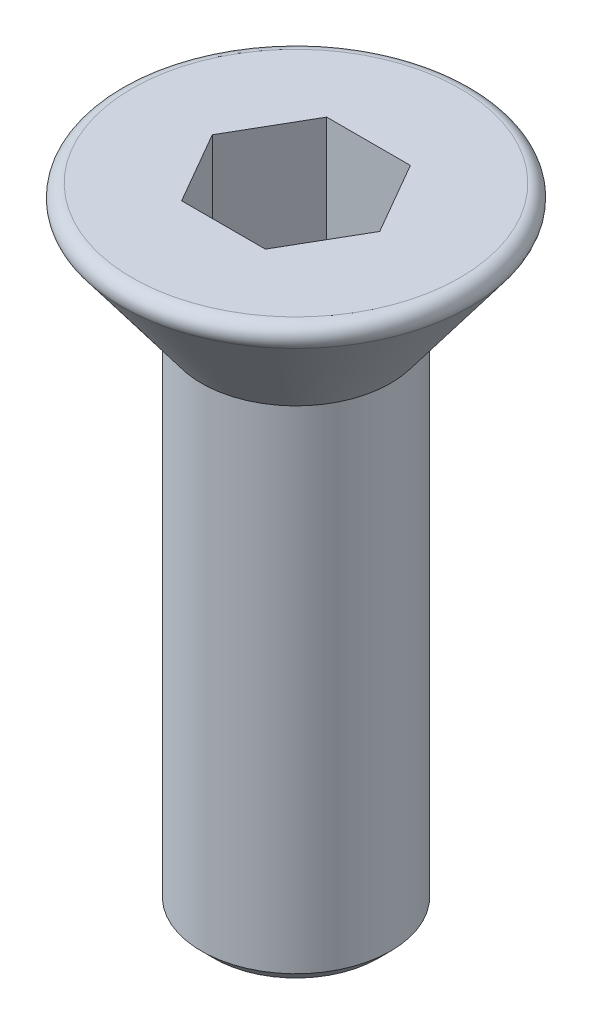
ISO-10303-21;
HEADER;
FILE_DESCRIPTION(('STEP AP214'),'2;1');
FILE_NAME('part.step','',(''),(''),'','','');
FILE_SCHEMA(('AUTOMOTIVE_DESIGN { 1 0 10303 214 1 1 1 1 }'));
ENDSEC;
DATA;
#1=APPLICATION_CONTEXT('core data for automotive mechanical design processes');
#2=APPLICATION_PROTOCOL_DEFINITION('international standard','automotive_design',2000,#1);
#3=PRODUCT_CONTEXT('',#1,'mechanical');
#4=PRODUCT('Part','Part','',(#3));
#5=PRODUCT_RELATED_PRODUCT_CATEGORY('part','',(#4));
#6=PRODUCT_DEFINITION_FORMATION('','',#4);
#7=PRODUCT_DEFINITION_CONTEXT('part definition',#1,'design');
#8=PRODUCT_DEFINITION('design','',#6,#7);
#9=PRODUCT_DEFINITION_SHAPE('','',#8);
#10=(LENGTH_UNIT() NAMED_UNIT(*) SI_UNIT(.MILLI.,.METRE.));
#11=(NAMED_UNIT(*) PLANE_ANGLE_UNIT() SI_UNIT($,.RADIAN.));
#12=(NAMED_UNIT(*) SI_UNIT($,.STERADIAN.) SOLID_ANGLE_UNIT());
#13=UNCERTAINTY_MEASURE_WITH_UNIT(LENGTH_MEASURE(1.E-05),#10,'distance_accuracy_value','');
#14=(GEOMETRIC_REPRESENTATION_CONTEXT(3) GLOBAL_UNCERTAINTY_ASSIGNED_CONTEXT((#13)) GLOBAL_UNIT_ASSIGNED_CONTEXT((#10,
#11,#12)) REPRESENTATION_CONTEXT('',''));
#15=CARTESIAN_POINT('',(0.,0.,0.));
#16=DIRECTION('',(0.,0.,1.));
#17=DIRECTION('',(1.,0.,0.));
#18=AXIS2_PLACEMENT_3D('',#15,#16,#17);
#19=CARTESIAN_POINT('',(3.,0.,0.));
#20=DIRECTION('',(0.,-1.,0.));
#21=DIRECTION('',(1.,0.,0.));
#22=AXIS2_PLACEMENT_3D('',#19,#20,#21);
#23=PLANE('',#22);
#24=CARTESIAN_POINT('',(0.,0.,0.));
#25=DIRECTION('',(0.,-1.,0.));
#26=DIRECTION('',(1.,0.,0.));
#27=AXIS2_PLACEMENT_3D('',#24,#25,#26);
#28=CIRCLE('',#27,2.6);
#29=CARTESIAN_POINT('',(2.6,0.,0.));
#30=VERTEX_POINT('',#29);
#31=EDGE_CURVE('E44',#30,#30,#28,.F.);
#32=ORIENTED_EDGE('',*,*,#31,.T.);
#33=EDGE_LOOP('',(#32));
#34=FACE_BOUND('',#33,.T.);
#35=DIRECTION('',(0.5,0.,0.866025403784439));
#36=VECTOR('',#35,1.);
#37=CARTESIAN_POINT('',(-1.32790561913614,0.,0.));
#38=LINE('',#37,#36);
#39=CARTESIAN_POINT('',(-1.32790561913614,0.,0.));
#40=VERTEX_POINT('',#39);
#41=CARTESIAN_POINT('',(-0.66395280956807,0.,1.15));
#42=VERTEX_POINT('',#41);
#43=EDGE_CURVE('E125',#40,#42,#38,.T.);
#44=ORIENTED_EDGE('',*,*,#43,.F.);
#45=DIRECTION('',(-0.5,0.,0.866025403784438));
#46=VECTOR('',#45,1.);
#47=CARTESIAN_POINT('',(-0.66395280956807,0.,-1.15));
#48=LINE('',#47,#46);
#49=CARTESIAN_POINT('',(-0.66395280956807,0.,-1.15));
#50=VERTEX_POINT('',#49);
#51=EDGE_CURVE('E51',#50,#40,#48,.T.);
#52=ORIENTED_EDGE('',*,*,#51,.F.);
#53=DIRECTION('',(-1.,0.,0.));
#54=VECTOR('',#53,1.);
#55=CARTESIAN_POINT('',(0.66395280956807,0.,-1.15));
#56=LINE('',#55,#54);
#57=CARTESIAN_POINT('',(0.66395280956807,0.,-1.15));
#58=VERTEX_POINT('',#57);
#59=EDGE_CURVE('E134',#58,#50,#56,.T.);
#60=ORIENTED_EDGE('',*,*,#59,.F.);
#61=DIRECTION('',(-0.5,0.,-0.866025403784439));
#62=VECTOR('',#61,1.);
#63=CARTESIAN_POINT('',(1.32790561913614,0.,0.));
#64=LINE('',#63,#62);
#65=CARTESIAN_POINT('',(1.32790561913614,0.,0.));
#66=VERTEX_POINT('',#65);
#67=EDGE_CURVE('E132',#66,#58,#64,.T.);
#68=ORIENTED_EDGE('',*,*,#67,.F.);
#69=DIRECTION('',(0.5,0.,-0.866025403784439));
#70=VECTOR('',#69,1.);
#71=CARTESIAN_POINT('',(0.66395280956807,0.,1.15));
#72=LINE('',#71,#70);
#73=CARTESIAN_POINT('',(0.66395280956807,0.,1.15));
#74=VERTEX_POINT('',#73);
#75=EDGE_CURVE('E99',#74,#66,#72,.T.);
#76=ORIENTED_EDGE('',*,*,#75,.F.);
#77=DIRECTION('',(1.,0.,0.));
#78=VECTOR('',#77,1.);
#79=CARTESIAN_POINT('',(-0.66395280956807,0.,1.15));
#80=LINE('',#79,#78);
#81=EDGE_CURVE('E128',#42,#74,#80,.T.);
#82=ORIENTED_EDGE('',*,*,#81,.F.);
#83=EDGE_LOOP('',(#44,#52,#60,#68,#76,#82));
#84=FACE_BOUND('',#83,.T.);
#85=ADVANCED_FACE('F36',(#34,#84),#23,.F.);
#86=CARTESIAN_POINT('',(0.,-2.,0.));
#87=DIRECTION('',(0.,1.,0.));
#88=DIRECTION('',(-1.,0.,0.));
#89=AXIS2_PLACEMENT_3D('',#86,#87,#88);
#90=CONICAL_SURFACE('',#89,1.5,0.643501108793284);
#91=CARTESIAN_POINT('',(0.,-0.32,0.));
#92=DIRECTION('',(0.,-1.,0.));
#93=DIRECTION('',(1.,0.,0.));
#94=AXIS2_PLACEMENT_3D('',#91,#92,#93);
#95=CIRCLE('',#94,2.76);
#96=CARTESIAN_POINT('',(2.76,-0.32,0.));
#97=VERTEX_POINT('',#96);
#98=EDGE_CURVE('E11',#97,#97,#95,.T.);
#99=ORIENTED_EDGE('',*,*,#98,.T.);
#100=EDGE_LOOP('',(#99));
#101=FACE_BOUND('',#100,.T.);
#102=CARTESIAN_POINT('',(0.,-2.,0.));
#103=DIRECTION('',(0.,-1.,0.));
#104=DIRECTION('',(1.,0.,0.));
#105=AXIS2_PLACEMENT_3D('',#102,#103,#104);
#106=CIRCLE('',#105,1.5);
#107=CARTESIAN_POINT('',(1.5,-2.,0.));
#108=VERTEX_POINT('',#107);
#109=EDGE_CURVE('E138',#108,#108,#106,.T.);
#110=ORIENTED_EDGE('',*,*,#109,.F.);
#111=EDGE_LOOP('',(#110));
#112=FACE_BOUND('',#111,.T.);
#113=ADVANCED_FACE('F165',(#101,#112),#90,.T.);
#114=CARTESIAN_POINT('',(0.,-10.,0.));
#115=DIRECTION('',(0.,1.,0.));
#116=DIRECTION('',(-1.,0.,0.));
#117=AXIS2_PLACEMENT_3D('',#114,#115,#116);
#118=CYLINDRICAL_SURFACE('',#117,1.5);
#119=CARTESIAN_POINT('',(0.,-9.8,0.));
#120=DIRECTION('',(0.,-1.,0.));
#121=DIRECTION('',(1.,0.,0.));
#122=AXIS2_PLACEMENT_3D('',#119,#120,#121);
#123=CIRCLE('',#122,1.5);
#124=CARTESIAN_POINT('',(1.5,-9.8,0.));
#125=VERTEX_POINT('',#124);
#126=EDGE_CURVE('E149',#125,#125,#123,.F.);
#127=ORIENTED_EDGE('',*,*,#126,.T.);
#128=EDGE_LOOP('',(#127));
#129=FACE_BOUND('',#128,.T.);
#130=ORIENTED_EDGE('',*,*,#109,.T.);
#131=EDGE_LOOP('',(#130));
#132=FACE_BOUND('',#131,.T.);
#133=ADVANCED_FACE('F170',(#129,#132),#118,.T.);
#134=CARTESIAN_POINT('',(0.,-10.,0.));
#135=DIRECTION('',(0.,-1.,0.));
#136=DIRECTION('',(1.,0.,0.));
#137=AXIS2_PLACEMENT_3D('',#134,#135,#136);
#138=PLANE('',#137);
#139=CARTESIAN_POINT('',(0.,-10.,0.));
#140=DIRECTION('',(0.,-1.,0.));
#141=DIRECTION('',(1.,0.,0.));
#142=AXIS2_PLACEMENT_3D('',#139,#140,#141);
#143=CIRCLE('',#142,1.3);
#144=CARTESIAN_POINT('',(1.3,-10.,0.));
#145=VERTEX_POINT('',#144);
#146=EDGE_CURVE('E146',#145,#145,#143,.T.);
#147=ORIENTED_EDGE('',*,*,#146,.T.);
#148=EDGE_LOOP('',(#147));
#149=FACE_BOUND('',#148,.T.);
#150=ADVANCED_FACE('F176',(#149),#138,.T.);
#151=CARTESIAN_POINT('',(-0.663952809568069,-2.,-1.15));
#152=DIRECTION('',(-0.866025403784439,0.,-0.5));
#153=DIRECTION('',(-0.5,0.,0.866025403784438));
#154=AXIS2_PLACEMENT_3D('',#151,#152,#153);
#155=PLANE('',#154);
#156=ORIENTED_EDGE('',*,*,#51,.T.);
#157=DIRECTION('',(0.,1.,0.));
#158=VECTOR('',#157,1.);
#159=CARTESIAN_POINT('',(-1.32790561913614,-2.,0.));
#160=LINE('',#159,#158);
#161=CARTESIAN_POINT('',(-1.32790561913614,-2.,0.));
#162=VERTEX_POINT('',#161);
#163=EDGE_CURVE('E81',#162,#40,#160,.T.);
#164=ORIENTED_EDGE('',*,*,#163,.F.);
#165=DIRECTION('',(-0.5,0.,0.866025403784438));
#166=VECTOR('',#165,1.);
#167=CARTESIAN_POINT('',(-0.663952809568069,-2.,-1.15));
#168=LINE('',#167,#166);
#169=CARTESIAN_POINT('',(-0.663952809568069,-2.,-1.15));
#170=VERTEX_POINT('',#169);
#171=EDGE_CURVE('E136',#170,#162,#168,.T.);
#172=ORIENTED_EDGE('',*,*,#171,.F.);
#173=DIRECTION('',(0.,1.,0.));
#174=VECTOR('',#173,1.);
#175=CARTESIAN_POINT('',(-0.663952809568069,-2.,-1.15));
#176=LINE('',#175,#174);
#177=EDGE_CURVE('E59',#170,#50,#176,.T.);
#178=ORIENTED_EDGE('',*,*,#177,.T.);
#179=EDGE_LOOP('',(#156,#164,#172,#178));
#180=FACE_BOUND('',#179,.T.);
#181=ADVANCED_FACE('F180',(#180),#155,.F.);
#182=CARTESIAN_POINT('',(0.66395280956807,-2.,-1.15));
#183=DIRECTION('',(0.,0.,-1.));
#184=DIRECTION('',(-1.,0.,0.));
#185=AXIS2_PLACEMENT_3D('',#182,#183,#184);
#186=PLANE('',#185);
#187=ORIENTED_EDGE('',*,*,#59,.T.);
#188=ORIENTED_EDGE('',*,*,#177,.F.);
#189=DIRECTION('',(-1.,0.,0.));
#190=VECTOR('',#189,1.);
#191=CARTESIAN_POINT('',(0.66395280956807,-2.,-1.15));
#192=LINE('',#191,#190);
#193=CARTESIAN_POINT('',(0.66395280956807,-2.,-1.15));
#194=VERTEX_POINT('',#193);
#195=EDGE_CURVE('E111',#194,#170,#192,.T.);
#196=ORIENTED_EDGE('',*,*,#195,.F.);
#197=DIRECTION('',(0.,1.,0.));
#198=VECTOR('',#197,1.);
#199=CARTESIAN_POINT('',(0.66395280956807,-2.,-1.15));
#200=LINE('',#199,#198);
#201=EDGE_CURVE('E103',#194,#58,#200,.T.);
#202=ORIENTED_EDGE('',*,*,#201,.T.);
#203=EDGE_LOOP('',(#187,#188,#196,#202));
#204=FACE_BOUND('',#203,.T.);
#205=ADVANCED_FACE('F184',(#204),#186,.F.);
#206=CARTESIAN_POINT('',(1.32790561913614,-2.,0.));
#207=DIRECTION('',(0.866025403784439,0.,-0.5));
#208=DIRECTION('',(-0.5,0.,-0.866025403784439));
#209=AXIS2_PLACEMENT_3D('',#206,#207,#208);
#210=PLANE('',#209);
#211=ORIENTED_EDGE('',*,*,#67,.T.);
#212=ORIENTED_EDGE('',*,*,#201,.F.);
#213=DIRECTION('',(-0.5,0.,-0.866025403784439));
#214=VECTOR('',#213,1.);
#215=CARTESIAN_POINT('',(1.32790561913614,-2.,0.));
#216=LINE('',#215,#214);
#217=CARTESIAN_POINT('',(1.32790561913614,-2.,0.));
#218=VERTEX_POINT('',#217);
#219=EDGE_CURVE('E107',#218,#194,#216,.T.);
#220=ORIENTED_EDGE('',*,*,#219,.F.);
#221=DIRECTION('',(0.,1.,0.));
#222=VECTOR('',#221,1.);
#223=CARTESIAN_POINT('',(1.32790561913614,-2.,0.));
#224=LINE('',#223,#222);
#225=EDGE_CURVE('E92',#218,#66,#224,.T.);
#226=ORIENTED_EDGE('',*,*,#225,.T.);
#227=EDGE_LOOP('',(#211,#212,#220,#226));
#228=FACE_BOUND('',#227,.T.);
#229=ADVANCED_FACE('F108',(#228),#210,.F.);
#230=CARTESIAN_POINT('',(0.66395280956807,-2.,1.15));
#231=DIRECTION('',(0.866025403784439,0.,0.5));
#232=DIRECTION('',(0.5,0.,-0.866025403784439));
#233=AXIS2_PLACEMENT_3D('',#230,#231,#232);
#234=PLANE('',#233);
#235=ORIENTED_EDGE('',*,*,#75,.T.);
#236=ORIENTED_EDGE('',*,*,#225,.F.);
#237=DIRECTION('',(0.5,0.,-0.866025403784439));
#238=VECTOR('',#237,1.);
#239=CARTESIAN_POINT('',(0.66395280956807,-2.,1.15));
#240=LINE('',#239,#238);
#241=CARTESIAN_POINT('',(0.66395280956807,-2.,1.15));
#242=VERTEX_POINT('',#241);
#243=EDGE_CURVE('E96',#242,#218,#240,.T.);
#244=ORIENTED_EDGE('',*,*,#243,.F.);
#245=DIRECTION('',(0.,1.,0.));
#246=VECTOR('',#245,1.);
#247=CARTESIAN_POINT('',(0.66395280956807,-2.,1.15));
#248=LINE('',#247,#246);
#249=EDGE_CURVE('E104',#242,#74,#248,.T.);
#250=ORIENTED_EDGE('',*,*,#249,.T.);
#251=EDGE_LOOP('',(#235,#236,#244,#250));
#252=FACE_BOUND('',#251,.T.);
#253=ADVANCED_FACE('F94',(#252),#234,.F.);
#254=CARTESIAN_POINT('',(-0.66395280956807,-2.,1.15));
#255=DIRECTION('',(0.,0.,1.));
#256=DIRECTION('',(1.,0.,0.));
#257=AXIS2_PLACEMENT_3D('',#254,#255,#256);
#258=PLANE('',#257);
#259=ORIENTED_EDGE('',*,*,#81,.T.);
#260=ORIENTED_EDGE('',*,*,#249,.F.);
#261=DIRECTION('',(1.,0.,0.));
#262=VECTOR('',#261,1.);
#263=CARTESIAN_POINT('',(-0.66395280956807,-2.,1.15));
#264=LINE('',#263,#262);
#265=CARTESIAN_POINT('',(-0.66395280956807,-2.,1.15));
#266=VERTEX_POINT('',#265);
#267=EDGE_CURVE('E117',#266,#242,#264,.T.);
#268=ORIENTED_EDGE('',*,*,#267,.F.);
#269=DIRECTION('',(0.,1.,0.));
#270=VECTOR('',#269,1.);
#271=CARTESIAN_POINT('',(-0.66395280956807,-2.,1.15));
#272=LINE('',#271,#270);
#273=EDGE_CURVE('E141',#266,#42,#272,.T.);
#274=ORIENTED_EDGE('',*,*,#273,.T.);
#275=EDGE_LOOP('',(#259,#260,#268,#274));
#276=FACE_BOUND('',#275,.T.);
#277=ADVANCED_FACE('F188',(#276),#258,.F.);
#278=CARTESIAN_POINT('',(-1.32790561913614,-2.,0.));
#279=DIRECTION('',(-0.866025403784439,0.,0.5));
#280=DIRECTION('',(0.5,0.,0.866025403784439));
#281=AXIS2_PLACEMENT_3D('',#278,#279,#280);
#282=PLANE('',#281);
#283=ORIENTED_EDGE('',*,*,#43,.T.);
#284=ORIENTED_EDGE('',*,*,#273,.F.);
#285=DIRECTION('',(0.5,0.,0.866025403784439));
#286=VECTOR('',#285,1.);
#287=CARTESIAN_POINT('',(-1.32790561913614,-2.,0.));
#288=LINE('',#287,#286);
#289=EDGE_CURVE('E119',#162,#266,#288,.T.);
#290=ORIENTED_EDGE('',*,*,#289,.F.);
#291=ORIENTED_EDGE('',*,*,#163,.T.);
#292=EDGE_LOOP('',(#283,#284,#290,#291));
#293=FACE_BOUND('',#292,.T.);
#294=ADVANCED_FACE('F185',(#293),#282,.F.);
#295=CARTESIAN_POINT('',(0.,-2.,0.));
#296=DIRECTION('',(0.,1.,0.));
#297=DIRECTION('',(-1.,0.,0.));
#298=AXIS2_PLACEMENT_3D('',#295,#296,#297);
#299=PLANE('',#298);
#300=ORIENTED_EDGE('',*,*,#171,.T.);
#301=ORIENTED_EDGE('',*,*,#289,.T.);
#302=ORIENTED_EDGE('',*,*,#267,.T.);
#303=ORIENTED_EDGE('',*,*,#243,.T.);
#304=ORIENTED_EDGE('',*,*,#219,.T.);
#305=ORIENTED_EDGE('',*,*,#195,.T.);
#306=EDGE_LOOP('',(#300,#301,#302,#303,#304,#305));
#307=FACE_BOUND('',#306,.T.);
#308=ADVANCED_FACE('F114',(#307),#299,.T.);
#309=CARTESIAN_POINT('',(0.,-10.,0.));
#310=DIRECTION('',(0.,1.,0.));
#311=DIRECTION('',(-1.,0.,0.));
#312=AXIS2_PLACEMENT_3D('',#309,#310,#311);
#313=CONICAL_SURFACE('',#312,1.3,0.785398163397445);
#314=ORIENTED_EDGE('',*,*,#126,.F.);
#315=EDGE_LOOP('',(#314));
#316=FACE_BOUND('',#315,.T.);
#317=ORIENTED_EDGE('',*,*,#146,.F.);
#318=EDGE_LOOP('',(#317));
#319=FACE_BOUND('',#318,.T.);
#320=ADVANCED_FACE('F157',(#316,#319),#313,.T.);
#321=CARTESIAN_POINT('',(0.,-0.2,0.));
#322=DIRECTION('',(0.,-1.,0.));
#323=DIRECTION('',(1.,0.,0.));
#324=AXIS2_PLACEMENT_3D('',#321,#322,#323);
#325=TOROIDAL_SURFACE('',#324,2.6,0.2);
#326=ORIENTED_EDGE('',*,*,#98,.F.);
#327=EDGE_LOOP('',(#326));
#328=FACE_BOUND('',#327,.T.);
#329=ORIENTED_EDGE('',*,*,#31,.F.);
#330=EDGE_LOOP('',(#329));
#331=FACE_BOUND('',#330,.T.);
#332=ADVANCED_FACE('F38',(#328,#331),#325,.T.);
#333=CLOSED_SHELL('',(#85,#113,#133,#150,#181,#205,#229,#253,#277,#294,#308,#320,#332));
#334=MANIFOLD_SOLID_BREP('B2',#333);
#335=ADVANCED_BREP_SHAPE_REPRESENTATION('',(#18,#334),#14);
#336=SHAPE_DEFINITION_REPRESENTATION(#9,#335);
ENDSEC;
END-ISO-10303-21;
